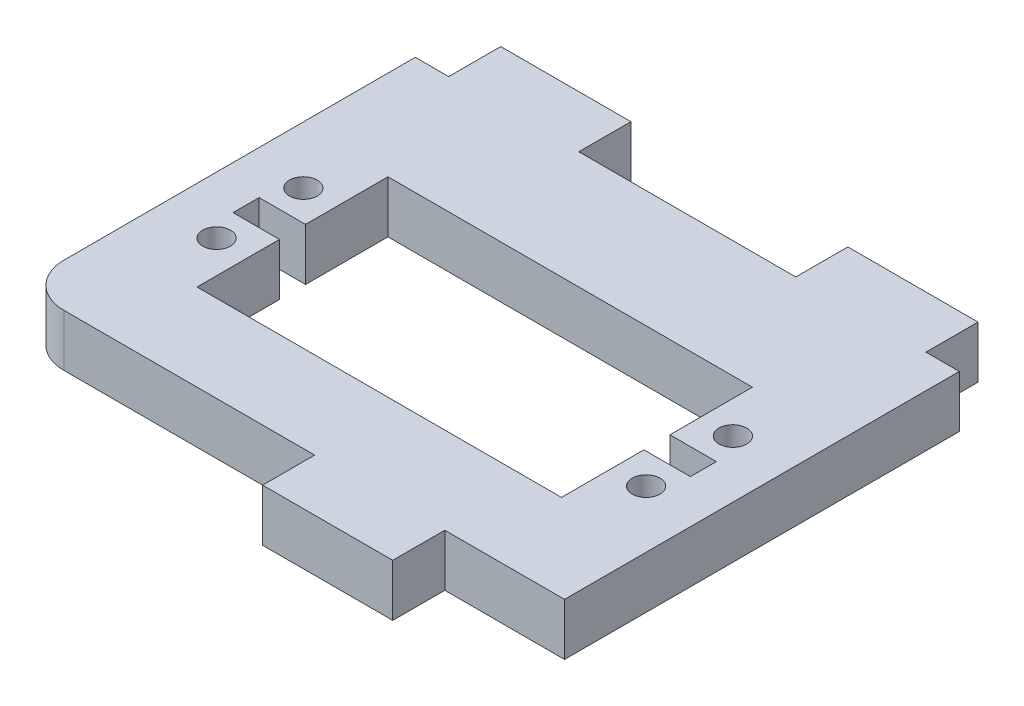
ISO-10303-21;
HEADER;
FILE_DESCRIPTION(('STEP AP214'),'2;1');
FILE_NAME('part.step','',(''),(''),'','','');
FILE_SCHEMA(('AUTOMOTIVE_DESIGN { 1 0 10303 214 1 1 1 1 }'));
ENDSEC;
DATA;
#1=APPLICATION_CONTEXT('core data for automotive mechanical design processes');
#2=APPLICATION_PROTOCOL_DEFINITION('international standard','automotive_design',2000,#1);
#3=PRODUCT_CONTEXT('',#1,'mechanical');
#4=PRODUCT('Part','Part','',(#3));
#5=PRODUCT_RELATED_PRODUCT_CATEGORY('part','',(#4));
#6=PRODUCT_DEFINITION_FORMATION('','',#4);
#7=PRODUCT_DEFINITION_CONTEXT('part definition',#1,'design');
#8=PRODUCT_DEFINITION('design','',#6,#7);
#9=PRODUCT_DEFINITION_SHAPE('','',#8);
#10=(LENGTH_UNIT() NAMED_UNIT(*) SI_UNIT(.MILLI.,.METRE.));
#11=(NAMED_UNIT(*) PLANE_ANGLE_UNIT() SI_UNIT($,.RADIAN.));
#12=(NAMED_UNIT(*) SI_UNIT($,.STERADIAN.) SOLID_ANGLE_UNIT());
#13=UNCERTAINTY_MEASURE_WITH_UNIT(LENGTH_MEASURE(1.E-05),#10,'distance_accuracy_value','');
#14=(GEOMETRIC_REPRESENTATION_CONTEXT(3) GLOBAL_UNCERTAINTY_ASSIGNED_CONTEXT((#13)) GLOBAL_UNIT_ASSIGNED_CONTEXT((#10,
#11,#12)) REPRESENTATION_CONTEXT('',''));
#15=CARTESIAN_POINT('',(0.,0.,0.));
#16=DIRECTION('',(0.,0.,1.));
#17=DIRECTION('',(1.,0.,0.));
#18=AXIS2_PLACEMENT_3D('',#15,#16,#17);
#19=CARTESIAN_POINT('',(2.55259,0.,27.));
#20=DIRECTION('',(-1.,0.,0.));
#21=DIRECTION('',(0.,0.,1.));
#22=AXIS2_PLACEMENT_3D('',#19,#20,#21);
#23=PLANE('',#22);
#24=DIRECTION('',(0.,0.,-1.));
#25=VECTOR('',#24,1.);
#26=CARTESIAN_POINT('',(2.55259,-6.,27.));
#27=LINE('',#26,#25);
#28=CARTESIAN_POINT('',(2.55259,-6.,27.));
#29=VERTEX_POINT('',#28);
#30=CARTESIAN_POINT('',(2.55258999999999,-6.,21.));
#31=VERTEX_POINT('',#30);
#32=EDGE_CURVE('E345',#29,#31,#27,.T.);
#33=ORIENTED_EDGE('',*,*,#32,.F.);
#34=DIRECTION('',(0.,-1.,0.));
#35=VECTOR('',#34,1.);
#36=CARTESIAN_POINT('',(2.55259,0.,27.));
#37=LINE('',#36,#35);
#38=CARTESIAN_POINT('',(2.55259,0.,27.));
#39=VERTEX_POINT('',#38);
#40=EDGE_CURVE('E11',#39,#29,#37,.T.);
#41=ORIENTED_EDGE('',*,*,#40,.F.);
#42=DIRECTION('',(0.,0.,-1.));
#43=VECTOR('',#42,1.);
#44=CARTESIAN_POINT('',(2.55259,0.,27.));
#45=LINE('',#44,#43);
#46=CARTESIAN_POINT('',(2.55258999999999,0.,21.));
#47=VERTEX_POINT('',#46);
#48=EDGE_CURVE('E348',#39,#47,#45,.T.);
#49=ORIENTED_EDGE('',*,*,#48,.T.);
#50=DIRECTION('',(0.,-1.,0.));
#51=VECTOR('',#50,1.);
#52=CARTESIAN_POINT('',(2.55258999999999,0.,21.));
#53=LINE('',#52,#51);
#54=EDGE_CURVE('E35',#47,#31,#53,.T.);
#55=ORIENTED_EDGE('',*,*,#54,.T.);
#56=EDGE_LOOP('',(#33,#41,#49,#55));
#57=FACE_BOUND('',#56,.T.);
#58=ADVANCED_FACE('F32',(#57),#23,.T.);
#59=CARTESIAN_POINT('',(17.55259,0.,27.));
#60=DIRECTION('',(0.,0.,1.));
#61=DIRECTION('',(1.,0.,0.));
#62=AXIS2_PLACEMENT_3D('',#59,#60,#61);
#63=PLANE('',#62);
#64=DIRECTION('',(-1.,0.,0.));
#65=VECTOR('',#64,1.);
#66=CARTESIAN_POINT('',(17.55259,-6.,27.));
#67=LINE('',#66,#65);
#68=CARTESIAN_POINT('',(17.55259,-6.,27.));
#69=VERTEX_POINT('',#68);
#70=EDGE_CURVE('E352',#69,#29,#67,.T.);
#71=ORIENTED_EDGE('',*,*,#70,.F.);
#72=DIRECTION('',(0.,-1.,0.));
#73=VECTOR('',#72,1.);
#74=CARTESIAN_POINT('',(17.55259,0.,27.));
#75=LINE('',#74,#73);
#76=CARTESIAN_POINT('',(17.55259,0.,27.));
#77=VERTEX_POINT('',#76);
#78=EDGE_CURVE('E40',#77,#69,#75,.T.);
#79=ORIENTED_EDGE('',*,*,#78,.F.);
#80=DIRECTION('',(-1.,0.,0.));
#81=VECTOR('',#80,1.);
#82=CARTESIAN_POINT('',(17.55259,0.,27.));
#83=LINE('',#82,#81);
#84=EDGE_CURVE('E397',#77,#39,#83,.T.);
#85=ORIENTED_EDGE('',*,*,#84,.T.);
#86=ORIENTED_EDGE('',*,*,#40,.T.);
#87=EDGE_LOOP('',(#71,#79,#85,#86));
#88=FACE_BOUND('',#87,.T.);
#89=ADVANCED_FACE('F489',(#88),#63,.T.);
#90=CARTESIAN_POINT('',(17.55259,0.,21.));
#91=DIRECTION('',(1.,0.,0.));
#92=DIRECTION('',(0.,0.,-1.));
#93=AXIS2_PLACEMENT_3D('',#90,#91,#92);
#94=PLANE('',#93);
#95=DIRECTION('',(0.,0.,1.));
#96=VECTOR('',#95,1.);
#97=CARTESIAN_POINT('',(17.55259,-6.,21.));
#98=LINE('',#97,#96);
#99=CARTESIAN_POINT('',(17.55259,-6.,21.));
#100=VERTEX_POINT('',#99);
#101=EDGE_CURVE('E444',#100,#69,#98,.T.);
#102=ORIENTED_EDGE('',*,*,#101,.F.);
#103=DIRECTION('',(0.,-1.,0.));
#104=VECTOR('',#103,1.);
#105=CARTESIAN_POINT('',(17.55259,0.,21.));
#106=LINE('',#105,#104);
#107=CARTESIAN_POINT('',(17.55259,0.,21.));
#108=VERTEX_POINT('',#107);
#109=EDGE_CURVE('E450',#108,#100,#106,.T.);
#110=ORIENTED_EDGE('',*,*,#109,.F.);
#111=DIRECTION('',(0.,0.,1.));
#112=VECTOR('',#111,1.);
#113=CARTESIAN_POINT('',(17.55259,0.,21.));
#114=LINE('',#113,#112);
#115=EDGE_CURVE('E394',#108,#77,#114,.T.);
#116=ORIENTED_EDGE('',*,*,#115,.T.);
#117=ORIENTED_EDGE('',*,*,#78,.T.);
#118=EDGE_LOOP('',(#102,#110,#116,#117));
#119=FACE_BOUND('',#118,.T.);
#120=ADVANCED_FACE('F545',(#119),#94,.T.);
#121=CARTESIAN_POINT('',(31.35,0.,21.));
#122=DIRECTION('',(0.,0.,1.));
#123=DIRECTION('',(1.,0.,0.));
#124=AXIS2_PLACEMENT_3D('',#121,#122,#123);
#125=PLANE('',#124);
#126=DIRECTION('',(-1.,0.,0.));
#127=VECTOR('',#126,1.);
#128=CARTESIAN_POINT('',(31.35,-6.,21.));
#129=LINE('',#128,#127);
#130=CARTESIAN_POINT('',(31.35,-6.,21.));
#131=VERTEX_POINT('',#130);
#132=EDGE_CURVE('E441',#131,#100,#129,.T.);
#133=ORIENTED_EDGE('',*,*,#132,.F.);
#134=DIRECTION('',(0.,-1.,0.));
#135=VECTOR('',#134,1.);
#136=CARTESIAN_POINT('',(31.35,0.,21.));
#137=LINE('',#136,#135);
#138=CARTESIAN_POINT('',(31.35,0.,21.));
#139=VERTEX_POINT('',#138);
#140=EDGE_CURVE('E452',#139,#131,#137,.T.);
#141=ORIENTED_EDGE('',*,*,#140,.F.);
#142=DIRECTION('',(-1.,0.,0.));
#143=VECTOR('',#142,1.);
#144=CARTESIAN_POINT('',(31.35,0.,21.));
#145=LINE('',#144,#143);
#146=EDGE_CURVE('E391',#139,#108,#145,.T.);
#147=ORIENTED_EDGE('',*,*,#146,.T.);
#148=ORIENTED_EDGE('',*,*,#109,.T.);
#149=EDGE_LOOP('',(#133,#141,#147,#148));
#150=FACE_BOUND('',#149,.T.);
#151=ADVANCED_FACE('F543',(#150),#125,.T.);
#152=CARTESIAN_POINT('',(31.35,0.,-24.5));
#153=DIRECTION('',(1.,0.,0.));
#154=DIRECTION('',(0.,0.,-1.));
#155=AXIS2_PLACEMENT_3D('',#152,#153,#154);
#156=PLANE('',#155);
#157=DIRECTION('',(0.,0.,1.));
#158=VECTOR('',#157,1.);
#159=CARTESIAN_POINT('',(31.35,-6.,-24.5));
#160=LINE('',#159,#158);
#161=CARTESIAN_POINT('',(31.35,-6.,-24.5));
#162=VERTEX_POINT('',#161);
#163=EDGE_CURVE('E438',#162,#131,#160,.T.);
#164=ORIENTED_EDGE('',*,*,#163,.F.);
#165=DIRECTION('',(0.,-1.,0.));
#166=VECTOR('',#165,1.);
#167=CARTESIAN_POINT('',(31.35,0.,-24.5));
#168=LINE('',#167,#166);
#169=CARTESIAN_POINT('',(31.35,0.,-24.5));
#170=VERTEX_POINT('',#169);
#171=EDGE_CURVE('E454',#170,#162,#168,.T.);
#172=ORIENTED_EDGE('',*,*,#171,.F.);
#173=DIRECTION('',(0.,0.,1.));
#174=VECTOR('',#173,1.);
#175=CARTESIAN_POINT('',(31.35,0.,-24.5));
#176=LINE('',#175,#174);
#177=EDGE_CURVE('E388',#170,#139,#176,.T.);
#178=ORIENTED_EDGE('',*,*,#177,.T.);
#179=ORIENTED_EDGE('',*,*,#140,.T.);
#180=EDGE_LOOP('',(#164,#172,#178,#179));
#181=FACE_BOUND('',#180,.T.);
#182=ADVANCED_FACE('F539',(#181),#156,.T.);
#183=CARTESIAN_POINT('',(27.5,0.,-24.5));
#184=DIRECTION('',(0.,0.,-1.));
#185=DIRECTION('',(-1.,0.,0.));
#186=AXIS2_PLACEMENT_3D('',#183,#184,#185);
#187=PLANE('',#186);
#188=DIRECTION('',(1.,0.,0.));
#189=VECTOR('',#188,1.);
#190=CARTESIAN_POINT('',(27.5,-6.,-24.5));
#191=LINE('',#190,#189);
#192=CARTESIAN_POINT('',(27.5,-6.,-24.5));
#193=VERTEX_POINT('',#192);
#194=EDGE_CURVE('E435',#193,#162,#191,.T.);
#195=ORIENTED_EDGE('',*,*,#194,.F.);
#196=DIRECTION('',(0.,-1.,0.));
#197=VECTOR('',#196,1.);
#198=CARTESIAN_POINT('',(27.5,0.,-24.5));
#199=LINE('',#198,#197);
#200=CARTESIAN_POINT('',(27.5,0.,-24.5));
#201=VERTEX_POINT('',#200);
#202=EDGE_CURVE('E456',#201,#193,#199,.T.);
#203=ORIENTED_EDGE('',*,*,#202,.F.);
#204=DIRECTION('',(1.,0.,0.));
#205=VECTOR('',#204,1.);
#206=CARTESIAN_POINT('',(27.5,0.,-24.5));
#207=LINE('',#206,#205);
#208=EDGE_CURVE('E385',#201,#170,#207,.T.);
#209=ORIENTED_EDGE('',*,*,#208,.T.);
#210=ORIENTED_EDGE('',*,*,#171,.T.);
#211=EDGE_LOOP('',(#195,#203,#209,#210));
#212=FACE_BOUND('',#211,.T.);
#213=ADVANCED_FACE('F535',(#212),#187,.T.);
#214=CARTESIAN_POINT('',(27.5,0.,-30.5));
#215=DIRECTION('',(1.,0.,0.));
#216=DIRECTION('',(0.,0.,-1.));
#217=AXIS2_PLACEMENT_3D('',#214,#215,#216);
#218=PLANE('',#217);
#219=DIRECTION('',(0.,0.,1.));
#220=VECTOR('',#219,1.);
#221=CARTESIAN_POINT('',(27.5,-6.,-30.5));
#222=LINE('',#221,#220);
#223=CARTESIAN_POINT('',(27.5,-6.,-30.5));
#224=VERTEX_POINT('',#223);
#225=EDGE_CURVE('E432',#224,#193,#222,.T.);
#226=ORIENTED_EDGE('',*,*,#225,.F.);
#227=DIRECTION('',(0.,-1.,0.));
#228=VECTOR('',#227,1.);
#229=CARTESIAN_POINT('',(27.5,0.,-30.5));
#230=LINE('',#229,#228);
#231=CARTESIAN_POINT('',(27.5,0.,-30.5));
#232=VERTEX_POINT('',#231);
#233=EDGE_CURVE('E458',#232,#224,#230,.T.);
#234=ORIENTED_EDGE('',*,*,#233,.F.);
#235=DIRECTION('',(0.,0.,1.));
#236=VECTOR('',#235,1.);
#237=CARTESIAN_POINT('',(27.5,0.,-30.5));
#238=LINE('',#237,#236);
#239=EDGE_CURVE('E382',#232,#201,#238,.T.);
#240=ORIENTED_EDGE('',*,*,#239,.T.);
#241=ORIENTED_EDGE('',*,*,#202,.T.);
#242=EDGE_LOOP('',(#226,#234,#240,#241));
#243=FACE_BOUND('',#242,.T.);
#244=ADVANCED_FACE('F531',(#243),#218,.T.);
#245=CARTESIAN_POINT('',(12.5,0.,-30.5));
#246=DIRECTION('',(0.,0.,-1.));
#247=DIRECTION('',(-1.,0.,0.));
#248=AXIS2_PLACEMENT_3D('',#245,#246,#247);
#249=PLANE('',#248);
#250=DIRECTION('',(1.,0.,0.));
#251=VECTOR('',#250,1.);
#252=CARTESIAN_POINT('',(12.5,-6.,-30.5));
#253=LINE('',#252,#251);
#254=CARTESIAN_POINT('',(12.5,-6.,-30.5));
#255=VERTEX_POINT('',#254);
#256=EDGE_CURVE('E429',#255,#224,#253,.T.);
#257=ORIENTED_EDGE('',*,*,#256,.F.);
#258=DIRECTION('',(0.,-1.,0.));
#259=VECTOR('',#258,1.);
#260=CARTESIAN_POINT('',(12.5,0.,-30.5));
#261=LINE('',#260,#259);
#262=CARTESIAN_POINT('',(12.5,0.,-30.5));
#263=VERTEX_POINT('',#262);
#264=EDGE_CURVE('E460',#263,#255,#261,.T.);
#265=ORIENTED_EDGE('',*,*,#264,.F.);
#266=DIRECTION('',(1.,0.,0.));
#267=VECTOR('',#266,1.);
#268=CARTESIAN_POINT('',(12.5,0.,-30.5));
#269=LINE('',#268,#267);
#270=EDGE_CURVE('E379',#263,#232,#269,.T.);
#271=ORIENTED_EDGE('',*,*,#270,.T.);
#272=ORIENTED_EDGE('',*,*,#233,.T.);
#273=EDGE_LOOP('',(#257,#265,#271,#272));
#274=FACE_BOUND('',#273,.T.);
#275=ADVANCED_FACE('F527',(#274),#249,.T.);
#276=CARTESIAN_POINT('',(12.5,0.,-24.5));
#277=DIRECTION('',(-1.,0.,0.));
#278=DIRECTION('',(0.,0.,1.));
#279=AXIS2_PLACEMENT_3D('',#276,#277,#278);
#280=PLANE('',#279);
#281=DIRECTION('',(0.,0.,-1.));
#282=VECTOR('',#281,1.);
#283=CARTESIAN_POINT('',(12.5,-6.,-24.5));
#284=LINE('',#283,#282);
#285=CARTESIAN_POINT('',(12.5,-6.,-24.5));
#286=VERTEX_POINT('',#285);
#287=EDGE_CURVE('E426',#286,#255,#284,.T.);
#288=ORIENTED_EDGE('',*,*,#287,.F.);
#289=DIRECTION('',(0.,-1.,0.));
#290=VECTOR('',#289,1.);
#291=CARTESIAN_POINT('',(12.5,0.,-24.5));
#292=LINE('',#291,#290);
#293=CARTESIAN_POINT('',(12.5,0.,-24.5));
#294=VERTEX_POINT('',#293);
#295=EDGE_CURVE('E462',#294,#286,#292,.T.);
#296=ORIENTED_EDGE('',*,*,#295,.F.);
#297=DIRECTION('',(0.,0.,-1.));
#298=VECTOR('',#297,1.);
#299=CARTESIAN_POINT('',(12.5,0.,-24.5));
#300=LINE('',#299,#298);
#301=EDGE_CURVE('E376',#294,#263,#300,.T.);
#302=ORIENTED_EDGE('',*,*,#301,.T.);
#303=ORIENTED_EDGE('',*,*,#264,.T.);
#304=EDGE_LOOP('',(#288,#296,#302,#303));
#305=FACE_BOUND('',#304,.T.);
#306=ADVANCED_FACE('F523',(#305),#280,.T.);
#307=CARTESIAN_POINT('',(-12.5,0.,-24.5));
#308=DIRECTION('',(0.,0.,-1.));
#309=DIRECTION('',(-1.,0.,0.));
#310=AXIS2_PLACEMENT_3D('',#307,#308,#309);
#311=PLANE('',#310);
#312=DIRECTION('',(1.,0.,0.));
#313=VECTOR('',#312,1.);
#314=CARTESIAN_POINT('',(-12.5,-6.,-24.5));
#315=LINE('',#314,#313);
#316=CARTESIAN_POINT('',(-12.5,-6.,-24.5));
#317=VERTEX_POINT('',#316);
#318=EDGE_CURVE('E423',#317,#286,#315,.T.);
#319=ORIENTED_EDGE('',*,*,#318,.F.);
#320=DIRECTION('',(0.,-1.,0.));
#321=VECTOR('',#320,1.);
#322=CARTESIAN_POINT('',(-12.5,0.,-24.5));
#323=LINE('',#322,#321);
#324=CARTESIAN_POINT('',(-12.5,0.,-24.5));
#325=VERTEX_POINT('',#324);
#326=EDGE_CURVE('E464',#325,#317,#323,.T.);
#327=ORIENTED_EDGE('',*,*,#326,.F.);
#328=DIRECTION('',(1.,0.,0.));
#329=VECTOR('',#328,1.);
#330=CARTESIAN_POINT('',(-12.5,0.,-24.5));
#331=LINE('',#330,#329);
#332=EDGE_CURVE('E373',#325,#294,#331,.T.);
#333=ORIENTED_EDGE('',*,*,#332,.T.);
#334=ORIENTED_EDGE('',*,*,#295,.T.);
#335=EDGE_LOOP('',(#319,#327,#333,#334));
#336=FACE_BOUND('',#335,.T.);
#337=ADVANCED_FACE('F519',(#336),#311,.T.);
#338=CARTESIAN_POINT('',(-12.5,0.,-30.5));
#339=DIRECTION('',(1.,0.,0.));
#340=DIRECTION('',(0.,0.,-1.));
#341=AXIS2_PLACEMENT_3D('',#338,#339,#340);
#342=PLANE('',#341);
#343=DIRECTION('',(0.,0.,1.));
#344=VECTOR('',#343,1.);
#345=CARTESIAN_POINT('',(-12.5,-6.,-30.5));
#346=LINE('',#345,#344);
#347=CARTESIAN_POINT('',(-12.5,-6.,-30.5));
#348=VERTEX_POINT('',#347);
#349=EDGE_CURVE('E420',#348,#317,#346,.T.);
#350=ORIENTED_EDGE('',*,*,#349,.F.);
#351=DIRECTION('',(0.,-1.,0.));
#352=VECTOR('',#351,1.);
#353=CARTESIAN_POINT('',(-12.5,0.,-30.5));
#354=LINE('',#353,#352);
#355=CARTESIAN_POINT('',(-12.5,0.,-30.5));
#356=VERTEX_POINT('',#355);
#357=EDGE_CURVE('E466',#356,#348,#354,.T.);
#358=ORIENTED_EDGE('',*,*,#357,.F.);
#359=DIRECTION('',(0.,0.,1.));
#360=VECTOR('',#359,1.);
#361=CARTESIAN_POINT('',(-12.5,0.,-30.5));
#362=LINE('',#361,#360);
#363=EDGE_CURVE('E370',#356,#325,#362,.T.);
#364=ORIENTED_EDGE('',*,*,#363,.T.);
#365=ORIENTED_EDGE('',*,*,#326,.T.);
#366=EDGE_LOOP('',(#350,#358,#364,#365));
#367=FACE_BOUND('',#366,.T.);
#368=ADVANCED_FACE('F515',(#367),#342,.T.);
#369=CARTESIAN_POINT('',(-27.5,0.,-30.5));
#370=DIRECTION('',(0.,0.,-1.));
#371=DIRECTION('',(-1.,0.,0.));
#372=AXIS2_PLACEMENT_3D('',#369,#370,#371);
#373=PLANE('',#372);
#374=DIRECTION('',(1.,0.,0.));
#375=VECTOR('',#374,1.);
#376=CARTESIAN_POINT('',(-27.5,-6.,-30.5));
#377=LINE('',#376,#375);
#378=CARTESIAN_POINT('',(-27.5,-6.,-30.5));
#379=VERTEX_POINT('',#378);
#380=EDGE_CURVE('E417',#379,#348,#377,.T.);
#381=ORIENTED_EDGE('',*,*,#380,.F.);
#382=DIRECTION('',(0.,-1.,0.));
#383=VECTOR('',#382,1.);
#384=CARTESIAN_POINT('',(-27.5,0.,-30.5));
#385=LINE('',#384,#383);
#386=CARTESIAN_POINT('',(-27.5,0.,-30.5));
#387=VERTEX_POINT('',#386);
#388=EDGE_CURVE('E468',#387,#379,#385,.T.);
#389=ORIENTED_EDGE('',*,*,#388,.F.);
#390=DIRECTION('',(1.,0.,0.));
#391=VECTOR('',#390,1.);
#392=CARTESIAN_POINT('',(-27.5,0.,-30.5));
#393=LINE('',#392,#391);
#394=EDGE_CURVE('E367',#387,#356,#393,.T.);
#395=ORIENTED_EDGE('',*,*,#394,.T.);
#396=ORIENTED_EDGE('',*,*,#357,.T.);
#397=EDGE_LOOP('',(#381,#389,#395,#396));
#398=FACE_BOUND('',#397,.T.);
#399=ADVANCED_FACE('F511',(#398),#373,.T.);
#400=CARTESIAN_POINT('',(-27.5,0.,-24.5));
#401=DIRECTION('',(-1.,0.,0.));
#402=DIRECTION('',(0.,0.,1.));
#403=AXIS2_PLACEMENT_3D('',#400,#401,#402);
#404=PLANE('',#403);
#405=DIRECTION('',(0.,0.,-1.));
#406=VECTOR('',#405,1.);
#407=CARTESIAN_POINT('',(-27.5,-6.,-24.5));
#408=LINE('',#407,#406);
#409=CARTESIAN_POINT('',(-27.5,-6.,-24.5));
#410=VERTEX_POINT('',#409);
#411=EDGE_CURVE('E414',#410,#379,#408,.T.);
#412=ORIENTED_EDGE('',*,*,#411,.F.);
#413=DIRECTION('',(0.,-1.,0.));
#414=VECTOR('',#413,1.);
#415=CARTESIAN_POINT('',(-27.5,0.,-24.5));
#416=LINE('',#415,#414);
#417=CARTESIAN_POINT('',(-27.5,0.,-24.5));
#418=VERTEX_POINT('',#417);
#419=EDGE_CURVE('E470',#418,#410,#416,.T.);
#420=ORIENTED_EDGE('',*,*,#419,.F.);
#421=DIRECTION('',(0.,0.,-1.));
#422=VECTOR('',#421,1.);
#423=CARTESIAN_POINT('',(-27.5,0.,-24.5));
#424=LINE('',#423,#422);
#425=EDGE_CURVE('E364',#418,#387,#424,.T.);
#426=ORIENTED_EDGE('',*,*,#425,.T.);
#427=ORIENTED_EDGE('',*,*,#388,.T.);
#428=EDGE_LOOP('',(#412,#420,#426,#427));
#429=FACE_BOUND('',#428,.T.);
#430=ADVANCED_FACE('F507',(#429),#404,.T.);
#431=CARTESIAN_POINT('',(-31.35,0.,-24.5));
#432=DIRECTION('',(0.,0.,-1.));
#433=DIRECTION('',(-1.,0.,0.));
#434=AXIS2_PLACEMENT_3D('',#431,#432,#433);
#435=PLANE('',#434);
#436=DIRECTION('',(1.,0.,0.));
#437=VECTOR('',#436,1.);
#438=CARTESIAN_POINT('',(-31.35,-6.,-24.5));
#439=LINE('',#438,#437);
#440=CARTESIAN_POINT('',(-31.35,-6.,-24.5));
#441=VERTEX_POINT('',#440);
#442=EDGE_CURVE('E411',#441,#410,#439,.T.);
#443=ORIENTED_EDGE('',*,*,#442,.F.);
#444=DIRECTION('',(0.,-1.,0.));
#445=VECTOR('',#444,1.);
#446=CARTESIAN_POINT('',(-31.35,0.,-24.5));
#447=LINE('',#446,#445);
#448=CARTESIAN_POINT('',(-31.35,0.,-24.5));
#449=VERTEX_POINT('',#448);
#450=EDGE_CURVE('E472',#449,#441,#447,.T.);
#451=ORIENTED_EDGE('',*,*,#450,.F.);
#452=DIRECTION('',(1.,0.,0.));
#453=VECTOR('',#452,1.);
#454=CARTESIAN_POINT('',(-31.35,0.,-24.5));
#455=LINE('',#454,#453);
#456=EDGE_CURVE('E361',#449,#418,#455,.T.);
#457=ORIENTED_EDGE('',*,*,#456,.T.);
#458=ORIENTED_EDGE('',*,*,#419,.T.);
#459=EDGE_LOOP('',(#443,#451,#457,#458));
#460=FACE_BOUND('',#459,.T.);
#461=ADVANCED_FACE('F503',(#460),#435,.T.);
#462=CARTESIAN_POINT('',(-31.35,0.,16.));
#463=DIRECTION('',(-1.,0.,0.));
#464=DIRECTION('',(0.,0.,1.));
#465=AXIS2_PLACEMENT_3D('',#462,#463,#464);
#466=PLANE('',#465);
#467=DIRECTION('',(0.,0.,-1.));
#468=VECTOR('',#467,1.);
#469=CARTESIAN_POINT('',(-31.35,-6.,16.));
#470=LINE('',#469,#468);
#471=CARTESIAN_POINT('',(-31.35,-6.,16.));
#472=VERTEX_POINT('',#471);
#473=EDGE_CURVE('E408',#472,#441,#470,.T.);
#474=ORIENTED_EDGE('',*,*,#473,.F.);
#475=DIRECTION('',(0.,-1.,0.));
#476=VECTOR('',#475,1.);
#477=CARTESIAN_POINT('',(-31.35,0.,16.));
#478=LINE('',#477,#476);
#479=CARTESIAN_POINT('',(-31.35,0.,16.));
#480=VERTEX_POINT('',#479);
#481=EDGE_CURVE('E474',#480,#472,#478,.T.);
#482=ORIENTED_EDGE('',*,*,#481,.F.);
#483=DIRECTION('',(0.,0.,-1.));
#484=VECTOR('',#483,1.);
#485=CARTESIAN_POINT('',(-31.35,0.,16.));
#486=LINE('',#485,#484);
#487=EDGE_CURVE('E358',#480,#449,#486,.T.);
#488=ORIENTED_EDGE('',*,*,#487,.T.);
#489=ORIENTED_EDGE('',*,*,#450,.T.);
#490=EDGE_LOOP('',(#474,#482,#488,#489));
#491=FACE_BOUND('',#490,.T.);
#492=ADVANCED_FACE('F501',(#491),#466,.T.);
#493=CARTESIAN_POINT('',(-26.35,0.,16.));
#494=DIRECTION('',(0.,-1.,0.));
#495=DIRECTION('',(0.,0.,-1.));
#496=AXIS2_PLACEMENT_3D('',#493,#494,#495);
#497=CYLINDRICAL_SURFACE('',#496,5.);
#498=CARTESIAN_POINT('',(-26.35,-6.,16.));
#499=DIRECTION('',(0.,-1.,0.));
#500=DIRECTION('',(0.,0.,-1.));
#501=AXIS2_PLACEMENT_3D('',#498,#499,#500);
#502=CIRCLE('',#501,5.);
#503=CARTESIAN_POINT('',(-26.35,-6.,21.));
#504=VERTEX_POINT('',#503);
#505=EDGE_CURVE('E405',#504,#472,#502,.T.);
#506=ORIENTED_EDGE('',*,*,#505,.F.);
#507=DIRECTION('',(0.,-1.,0.));
#508=VECTOR('',#507,1.);
#509=CARTESIAN_POINT('',(-26.35,0.,21.));
#510=LINE('',#509,#508);
#511=CARTESIAN_POINT('',(-26.35,0.,21.));
#512=VERTEX_POINT('',#511);
#513=EDGE_CURVE('E475',#512,#504,#510,.T.);
#514=ORIENTED_EDGE('',*,*,#513,.F.);
#515=CARTESIAN_POINT('',(-26.35,0.,16.));
#516=DIRECTION('',(0.,-1.,0.));
#517=DIRECTION('',(0.,0.,-1.));
#518=AXIS2_PLACEMENT_3D('',#515,#516,#517);
#519=CIRCLE('',#518,5.);
#520=EDGE_CURVE('E355',#512,#480,#519,.T.);
#521=ORIENTED_EDGE('',*,*,#520,.T.);
#522=ORIENTED_EDGE('',*,*,#481,.T.);
#523=EDGE_LOOP('',(#506,#514,#521,#522));
#524=FACE_BOUND('',#523,.T.);
#525=ADVANCED_FACE('F497',(#524),#497,.T.);
#526=CARTESIAN_POINT('',(2.55258999999999,0.,21.));
#527=DIRECTION('',(0.,0.,1.));
#528=DIRECTION('',(1.,0.,0.));
#529=AXIS2_PLACEMENT_3D('',#526,#527,#528);
#530=PLANE('',#529);
#531=DIRECTION('',(-1.,0.,0.));
#532=VECTOR('',#531,1.);
#533=CARTESIAN_POINT('',(2.55258999999999,-6.,21.));
#534=LINE('',#533,#532);
#535=EDGE_CURVE('E402',#31,#504,#534,.T.);
#536=ORIENTED_EDGE('',*,*,#535,.F.);
#537=ORIENTED_EDGE('',*,*,#54,.F.);
#538=DIRECTION('',(-1.,0.,0.));
#539=VECTOR('',#538,1.);
#540=CARTESIAN_POINT('',(2.55258999999999,0.,21.));
#541=LINE('',#540,#539);
#542=EDGE_CURVE('E351',#47,#512,#541,.T.);
#543=ORIENTED_EDGE('',*,*,#542,.T.);
#544=ORIENTED_EDGE('',*,*,#513,.T.);
#545=EDGE_LOOP('',(#536,#537,#543,#544));
#546=FACE_BOUND('',#545,.T.);
#547=ADVANCED_FACE('F483',(#546),#530,.T.);
#548=CARTESIAN_POINT('',(-26.35,0.,16.));
#549=DIRECTION('',(0.,-1.,0.));
#550=DIRECTION('',(0.,0.,-1.));
#551=AXIS2_PLACEMENT_3D('',#548,#549,#550);
#552=PLANE('',#551);
#553=DIRECTION('',(-1.,0.,0.));
#554=VECTOR('',#553,1.);
#555=CARTESIAN_POINT('',(-26.35,0.,1.5));
#556=LINE('',#555,#554);
#557=CARTESIAN_POINT('',(-21.,0.,1.5));
#558=VERTEX_POINT('',#557);
#559=CARTESIAN_POINT('',(-26.35,0.,1.5));
#560=VERTEX_POINT('',#559);
#561=EDGE_CURVE('E231',#558,#560,#556,.T.);
#562=ORIENTED_EDGE('',*,*,#561,.T.);
#563=DIRECTION('',(0.,0.,-1.));
#564=VECTOR('',#563,1.);
#565=CARTESIAN_POINT('',(-26.35,0.,-1.5));
#566=LINE('',#565,#564);
#567=CARTESIAN_POINT('',(-26.35,0.,-1.5));
#568=VERTEX_POINT('',#567);
#569=EDGE_CURVE('E225',#560,#568,#566,.T.);
#570=ORIENTED_EDGE('',*,*,#569,.T.);
#571=DIRECTION('',(1.,0.,0.));
#572=VECTOR('',#571,1.);
#573=CARTESIAN_POINT('',(-21.,0.,-1.5));
#574=LINE('',#573,#572);
#575=CARTESIAN_POINT('',(-21.,0.,-1.5));
#576=VERTEX_POINT('',#575);
#577=EDGE_CURVE('E234',#568,#576,#574,.T.);
#578=ORIENTED_EDGE('',*,*,#577,.T.);
#579=DIRECTION('',(0.,0.,-1.));
#580=VECTOR('',#579,1.);
#581=CARTESIAN_POINT('',(-21.,0.,-11.));
#582=LINE('',#581,#580);
#583=CARTESIAN_POINT('',(-21.,0.,-11.));
#584=VERTEX_POINT('',#583);
#585=EDGE_CURVE('E48',#576,#584,#582,.T.);
#586=ORIENTED_EDGE('',*,*,#585,.T.);
#587=DIRECTION('',(1.,0.,0.));
#588=VECTOR('',#587,1.);
#589=CARTESIAN_POINT('',(21.,0.,-11.));
#590=LINE('',#589,#588);
#591=CARTESIAN_POINT('',(21.,0.,-11.));
#592=VERTEX_POINT('',#591);
#593=EDGE_CURVE('E249',#584,#592,#590,.T.);
#594=ORIENTED_EDGE('',*,*,#593,.T.);
#595=DIRECTION('',(0.,0.,1.));
#596=VECTOR('',#595,1.);
#597=CARTESIAN_POINT('',(21.,0.,-1.49999999999999));
#598=LINE('',#597,#596);
#599=CARTESIAN_POINT('',(21.,0.,-1.49999999999999));
#600=VERTEX_POINT('',#599);
#601=EDGE_CURVE('E252',#592,#600,#598,.T.);
#602=ORIENTED_EDGE('',*,*,#601,.T.);
#603=DIRECTION('',(1.,0.,0.));
#604=VECTOR('',#603,1.);
#605=CARTESIAN_POINT('',(26.35,0.,-1.49999999999999));
#606=LINE('',#605,#604);
#607=CARTESIAN_POINT('',(26.35,0.,-1.49999999999999));
#608=VERTEX_POINT('',#607);
#609=EDGE_CURVE('E255',#600,#608,#606,.T.);
#610=ORIENTED_EDGE('',*,*,#609,.T.);
#611=DIRECTION('',(0.,0.,1.));
#612=VECTOR('',#611,1.);
#613=CARTESIAN_POINT('',(26.35,0.,1.49999999999999));
#614=LINE('',#613,#612);
#615=CARTESIAN_POINT('',(26.35,0.,1.49999999999999));
#616=VERTEX_POINT('',#615);
#617=EDGE_CURVE('E258',#608,#616,#614,.T.);
#618=ORIENTED_EDGE('',*,*,#617,.T.);
#619=DIRECTION('',(-1.,0.,0.));
#620=VECTOR('',#619,1.);
#621=CARTESIAN_POINT('',(21.,0.,1.49999999999999));
#622=LINE('',#621,#620);
#623=CARTESIAN_POINT('',(21.,0.,1.49999999999999));
#624=VERTEX_POINT('',#623);
#625=EDGE_CURVE('E261',#616,#624,#622,.T.);
#626=ORIENTED_EDGE('',*,*,#625,.T.);
#627=DIRECTION('',(0.,0.,1.));
#628=VECTOR('',#627,1.);
#629=CARTESIAN_POINT('',(21.,0.,11.));
#630=LINE('',#629,#628);
#631=CARTESIAN_POINT('',(21.,0.,11.));
#632=VERTEX_POINT('',#631);
#633=EDGE_CURVE('E264',#624,#632,#630,.T.);
#634=ORIENTED_EDGE('',*,*,#633,.T.);
#635=DIRECTION('',(-1.,0.,0.));
#636=VECTOR('',#635,1.);
#637=CARTESIAN_POINT('',(-21.,0.,11.));
#638=LINE('',#637,#636);
#639=CARTESIAN_POINT('',(-21.,0.,11.));
#640=VERTEX_POINT('',#639);
#641=EDGE_CURVE('E267',#632,#640,#638,.T.);
#642=ORIENTED_EDGE('',*,*,#641,.T.);
#643=DIRECTION('',(0.,0.,-1.));
#644=VECTOR('',#643,1.);
#645=CARTESIAN_POINT('',(-21.,0.,1.5));
#646=LINE('',#645,#644);
#647=EDGE_CURVE('E270',#640,#558,#646,.T.);
#648=ORIENTED_EDGE('',*,*,#647,.T.);
#649=EDGE_LOOP('',(#562,#570,#578,#586,#594,#602,#610,#618,#626,#634,#642,#648));
#650=FACE_BOUND('',#649,.T.);
#651=CARTESIAN_POINT('',(-24.75,0.,-5.));
#652=DIRECTION('',(0.,-1.,0.));
#653=DIRECTION('',(0.,0.,1.));
#654=AXIS2_PLACEMENT_3D('',#651,#652,#653);
#655=CIRCLE('',#654,1.60000000000001);
#656=CARTESIAN_POINT('',(-24.75,0.,-3.39999999999999));
#657=VERTEX_POINT('',#656);
#658=EDGE_CURVE('E324',#657,#657,#655,.T.);
#659=ORIENTED_EDGE('',*,*,#658,.T.);
#660=EDGE_LOOP('',(#659));
#661=FACE_BOUND('',#660,.T.);
#662=CARTESIAN_POINT('',(-24.75,0.,5.));
#663=DIRECTION('',(0.,-1.,0.));
#664=DIRECTION('',(0.,0.,1.));
#665=AXIS2_PLACEMENT_3D('',#662,#663,#664);
#666=CIRCLE('',#665,1.60000000000001);
#667=CARTESIAN_POINT('',(-24.75,0.,6.6));
#668=VERTEX_POINT('',#667);
#669=EDGE_CURVE('E330',#668,#668,#666,.T.);
#670=ORIENTED_EDGE('',*,*,#669,.T.);
#671=EDGE_LOOP('',(#670));
#672=FACE_BOUND('',#671,.T.);
#673=CARTESIAN_POINT('',(24.75,0.,-5.));
#674=DIRECTION('',(0.,-1.,0.));
#675=DIRECTION('',(0.,0.,1.));
#676=AXIS2_PLACEMENT_3D('',#673,#674,#675);
#677=CIRCLE('',#676,1.60000000000001);
#678=CARTESIAN_POINT('',(24.75,0.,-3.39999999999999));
#679=VERTEX_POINT('',#678);
#680=EDGE_CURVE('E336',#679,#679,#677,.T.);
#681=ORIENTED_EDGE('',*,*,#680,.T.);
#682=EDGE_LOOP('',(#681));
#683=FACE_BOUND('',#682,.T.);
#684=CARTESIAN_POINT('',(24.75,0.,5.));
#685=DIRECTION('',(0.,-1.,0.));
#686=DIRECTION('',(0.,0.,1.));
#687=AXIS2_PLACEMENT_3D('',#684,#685,#686);
#688=CIRCLE('',#687,1.60000000000001);
#689=CARTESIAN_POINT('',(24.75,0.,6.6));
#690=VERTEX_POINT('',#689);
#691=EDGE_CURVE('E342',#690,#690,#688,.T.);
#692=ORIENTED_EDGE('',*,*,#691,.T.);
#693=EDGE_LOOP('',(#692));
#694=FACE_BOUND('',#693,.T.);
#695=ORIENTED_EDGE('',*,*,#48,.F.);
#696=ORIENTED_EDGE('',*,*,#84,.F.);
#697=ORIENTED_EDGE('',*,*,#115,.F.);
#698=ORIENTED_EDGE('',*,*,#146,.F.);
#699=ORIENTED_EDGE('',*,*,#177,.F.);
#700=ORIENTED_EDGE('',*,*,#208,.F.);
#701=ORIENTED_EDGE('',*,*,#239,.F.);
#702=ORIENTED_EDGE('',*,*,#270,.F.);
#703=ORIENTED_EDGE('',*,*,#301,.F.);
#704=ORIENTED_EDGE('',*,*,#332,.F.);
#705=ORIENTED_EDGE('',*,*,#363,.F.);
#706=ORIENTED_EDGE('',*,*,#394,.F.);
#707=ORIENTED_EDGE('',*,*,#425,.F.);
#708=ORIENTED_EDGE('',*,*,#456,.F.);
#709=ORIENTED_EDGE('',*,*,#487,.F.);
#710=ORIENTED_EDGE('',*,*,#520,.F.);
#711=ORIENTED_EDGE('',*,*,#542,.F.);
#712=EDGE_LOOP('',(#695,#696,#697,#698,#699,#700,#701,#702,#703,#704,#705,#706,#707,#708,#709,
#710,#711));
#713=FACE_BOUND('',#712,.T.);
#714=ADVANCED_FACE('F238',(#650,#661,#672,#683,#694,#713),#552,.F.);
#715=CARTESIAN_POINT('',(-26.35,-6.,16.));
#716=DIRECTION('',(0.,-1.,0.));
#717=DIRECTION('',(0.,0.,-1.));
#718=AXIS2_PLACEMENT_3D('',#715,#716,#717);
#719=PLANE('',#718);
#720=DIRECTION('',(0.,0.,-1.));
#721=VECTOR('',#720,1.);
#722=CARTESIAN_POINT('',(-26.35,-6.,-1.5));
#723=LINE('',#722,#721);
#724=CARTESIAN_POINT('',(-26.35,-6.,1.5));
#725=VERTEX_POINT('',#724);
#726=CARTESIAN_POINT('',(-26.35,-6.,-1.5));
#727=VERTEX_POINT('',#726);
#728=EDGE_CURVE('E56',#725,#727,#723,.T.);
#729=ORIENTED_EDGE('',*,*,#728,.F.);
#730=DIRECTION('',(-1.,0.,0.));
#731=VECTOR('',#730,1.);
#732=CARTESIAN_POINT('',(-26.35,-6.,1.5));
#733=LINE('',#732,#731);
#734=CARTESIAN_POINT('',(-21.,-6.,1.5));
#735=VERTEX_POINT('',#734);
#736=EDGE_CURVE('E242',#735,#725,#733,.T.);
#737=ORIENTED_EDGE('',*,*,#736,.F.);
#738=DIRECTION('',(0.,0.,-1.));
#739=VECTOR('',#738,1.);
#740=CARTESIAN_POINT('',(-21.,-6.,1.5));
#741=LINE('',#740,#739);
#742=CARTESIAN_POINT('',(-21.,-6.,11.));
#743=VERTEX_POINT('',#742);
#744=EDGE_CURVE('E245',#743,#735,#741,.T.);
#745=ORIENTED_EDGE('',*,*,#744,.F.);
#746=DIRECTION('',(-1.,0.,0.));
#747=VECTOR('',#746,1.);
#748=CARTESIAN_POINT('',(-21.,-6.,11.));
#749=LINE('',#748,#747);
#750=CARTESIAN_POINT('',(21.,-6.,11.));
#751=VERTEX_POINT('',#750);
#752=EDGE_CURVE('E297',#751,#743,#749,.T.);
#753=ORIENTED_EDGE('',*,*,#752,.F.);
#754=DIRECTION('',(0.,0.,1.));
#755=VECTOR('',#754,1.);
#756=CARTESIAN_POINT('',(21.,-6.,11.));
#757=LINE('',#756,#755);
#758=CARTESIAN_POINT('',(21.,-6.,1.49999999999999));
#759=VERTEX_POINT('',#758);
#760=EDGE_CURVE('E294',#759,#751,#757,.T.);
#761=ORIENTED_EDGE('',*,*,#760,.F.);
#762=DIRECTION('',(-1.,0.,0.));
#763=VECTOR('',#762,1.);
#764=CARTESIAN_POINT('',(21.,-6.,1.49999999999999));
#765=LINE('',#764,#763);
#766=CARTESIAN_POINT('',(26.35,-6.,1.49999999999999));
#767=VERTEX_POINT('',#766);
#768=EDGE_CURVE('E291',#767,#759,#765,.T.);
#769=ORIENTED_EDGE('',*,*,#768,.F.);
#770=DIRECTION('',(0.,0.,1.));
#771=VECTOR('',#770,1.);
#772=CARTESIAN_POINT('',(26.35,-6.,1.49999999999999));
#773=LINE('',#772,#771);
#774=CARTESIAN_POINT('',(26.35,-6.,-1.49999999999999));
#775=VERTEX_POINT('',#774);
#776=EDGE_CURVE('E288',#775,#767,#773,.T.);
#777=ORIENTED_EDGE('',*,*,#776,.F.);
#778=DIRECTION('',(1.,0.,0.));
#779=VECTOR('',#778,1.);
#780=CARTESIAN_POINT('',(26.35,-6.,-1.49999999999999));
#781=LINE('',#780,#779);
#782=CARTESIAN_POINT('',(21.,-6.,-1.49999999999999));
#783=VERTEX_POINT('',#782);
#784=EDGE_CURVE('E285',#783,#775,#781,.T.);
#785=ORIENTED_EDGE('',*,*,#784,.F.);
#786=DIRECTION('',(0.,0.,1.));
#787=VECTOR('',#786,1.);
#788=CARTESIAN_POINT('',(21.,-6.,-1.49999999999999));
#789=LINE('',#788,#787);
#790=CARTESIAN_POINT('',(21.,-6.,-11.));
#791=VERTEX_POINT('',#790);
#792=EDGE_CURVE('E282',#791,#783,#789,.T.);
#793=ORIENTED_EDGE('',*,*,#792,.F.);
#794=DIRECTION('',(1.,0.,0.));
#795=VECTOR('',#794,1.);
#796=CARTESIAN_POINT('',(21.,-6.,-11.));
#797=LINE('',#796,#795);
#798=CARTESIAN_POINT('',(-21.,-6.,-11.));
#799=VERTEX_POINT('',#798);
#800=EDGE_CURVE('E279',#799,#791,#797,.T.);
#801=ORIENTED_EDGE('',*,*,#800,.F.);
#802=DIRECTION('',(0.,0.,-1.));
#803=VECTOR('',#802,1.);
#804=CARTESIAN_POINT('',(-21.,-6.,-11.));
#805=LINE('',#804,#803);
#806=CARTESIAN_POINT('',(-21.,-6.,-1.5));
#807=VERTEX_POINT('',#806);
#808=EDGE_CURVE('E276',#807,#799,#805,.T.);
#809=ORIENTED_EDGE('',*,*,#808,.F.);
#810=DIRECTION('',(1.,0.,0.));
#811=VECTOR('',#810,1.);
#812=CARTESIAN_POINT('',(-21.,-6.,-1.5));
#813=LINE('',#812,#811);
#814=EDGE_CURVE('E274',#727,#807,#813,.T.);
#815=ORIENTED_EDGE('',*,*,#814,.F.);
#816=EDGE_LOOP('',(#729,#737,#745,#753,#761,#769,#777,#785,#793,#801,#809,#815));
#817=FACE_BOUND('',#816,.T.);
#818=CARTESIAN_POINT('',(-24.75,-6.,-5.));
#819=DIRECTION('',(0.,-1.,0.));
#820=DIRECTION('',(0.,0.,1.));
#821=AXIS2_PLACEMENT_3D('',#818,#819,#820);
#822=CIRCLE('',#821,1.60000000000001);
#823=CARTESIAN_POINT('',(-24.75,-6.,-3.39999999999999));
#824=VERTEX_POINT('',#823);
#825=EDGE_CURVE('E304',#824,#824,#822,.T.);
#826=ORIENTED_EDGE('',*,*,#825,.F.);
#827=EDGE_LOOP('',(#826));
#828=FACE_BOUND('',#827,.T.);
#829=CARTESIAN_POINT('',(-24.75,-6.,5.));
#830=DIRECTION('',(0.,-1.,0.));
#831=DIRECTION('',(0.,0.,1.));
#832=AXIS2_PLACEMENT_3D('',#829,#830,#831);
#833=CIRCLE('',#832,1.60000000000001);
#834=CARTESIAN_POINT('',(-24.75,-6.,6.6));
#835=VERTEX_POINT('',#834);
#836=EDGE_CURVE('E327',#835,#835,#833,.T.);
#837=ORIENTED_EDGE('',*,*,#836,.F.);
#838=EDGE_LOOP('',(#837));
#839=FACE_BOUND('',#838,.T.);
#840=CARTESIAN_POINT('',(24.75,-6.,-5.));
#841=DIRECTION('',(0.,-1.,0.));
#842=DIRECTION('',(0.,0.,1.));
#843=AXIS2_PLACEMENT_3D('',#840,#841,#842);
#844=CIRCLE('',#843,1.60000000000001);
#845=CARTESIAN_POINT('',(24.75,-6.,-3.39999999999999));
#846=VERTEX_POINT('',#845);
#847=EDGE_CURVE('E333',#846,#846,#844,.T.);
#848=ORIENTED_EDGE('',*,*,#847,.F.);
#849=EDGE_LOOP('',(#848));
#850=FACE_BOUND('',#849,.T.);
#851=CARTESIAN_POINT('',(24.75,-6.,5.));
#852=DIRECTION('',(0.,-1.,0.));
#853=DIRECTION('',(0.,0.,1.));
#854=AXIS2_PLACEMENT_3D('',#851,#852,#853);
#855=CIRCLE('',#854,1.60000000000001);
#856=CARTESIAN_POINT('',(24.75,-6.,6.6));
#857=VERTEX_POINT('',#856);
#858=EDGE_CURVE('E339',#857,#857,#855,.T.);
#859=ORIENTED_EDGE('',*,*,#858,.F.);
#860=EDGE_LOOP('',(#859));
#861=FACE_BOUND('',#860,.T.);
#862=ORIENTED_EDGE('',*,*,#32,.T.);
#863=ORIENTED_EDGE('',*,*,#535,.T.);
#864=ORIENTED_EDGE('',*,*,#505,.T.);
#865=ORIENTED_EDGE('',*,*,#473,.T.);
#866=ORIENTED_EDGE('',*,*,#442,.T.);
#867=ORIENTED_EDGE('',*,*,#411,.T.);
#868=ORIENTED_EDGE('',*,*,#380,.T.);
#869=ORIENTED_EDGE('',*,*,#349,.T.);
#870=ORIENTED_EDGE('',*,*,#318,.T.);
#871=ORIENTED_EDGE('',*,*,#287,.T.);
#872=ORIENTED_EDGE('',*,*,#256,.T.);
#873=ORIENTED_EDGE('',*,*,#225,.T.);
#874=ORIENTED_EDGE('',*,*,#194,.T.);
#875=ORIENTED_EDGE('',*,*,#163,.T.);
#876=ORIENTED_EDGE('',*,*,#132,.T.);
#877=ORIENTED_EDGE('',*,*,#101,.T.);
#878=ORIENTED_EDGE('',*,*,#70,.T.);
#879=EDGE_LOOP('',(#862,#863,#864,#865,#866,#867,#868,#869,#870,#871,#872,#873,#874,#875,#876,
#877,#878));
#880=FACE_BOUND('',#879,.T.);
#881=ADVANCED_FACE('F485',(#817,#828,#839,#850,#861,#880),#719,.T.);
#882=CARTESIAN_POINT('',(24.75,0.,5.));
#883=DIRECTION('',(0.,-1.,0.));
#884=DIRECTION('',(0.,0.,-1.));
#885=AXIS2_PLACEMENT_3D('',#882,#883,#884);
#886=CYLINDRICAL_SURFACE('',#885,1.60000000000001);
#887=ORIENTED_EDGE('',*,*,#691,.F.);
#888=EDGE_LOOP('',(#887));
#889=FACE_BOUND('',#888,.T.);
#890=ORIENTED_EDGE('',*,*,#858,.T.);
#891=EDGE_LOOP('',(#890));
#892=FACE_BOUND('',#891,.T.);
#893=ADVANCED_FACE('F691',(#889,#892),#886,.F.);
#894=CARTESIAN_POINT('',(24.75,0.,-5.));
#895=DIRECTION('',(0.,-1.,0.));
#896=DIRECTION('',(0.,0.,-1.));
#897=AXIS2_PLACEMENT_3D('',#894,#895,#896);
#898=CYLINDRICAL_SURFACE('',#897,1.60000000000001);
#899=ORIENTED_EDGE('',*,*,#680,.F.);
#900=EDGE_LOOP('',(#899));
#901=FACE_BOUND('',#900,.T.);
#902=ORIENTED_EDGE('',*,*,#847,.T.);
#903=EDGE_LOOP('',(#902));
#904=FACE_BOUND('',#903,.T.);
#905=ADVANCED_FACE('F701',(#901,#904),#898,.F.);
#906=CARTESIAN_POINT('',(-24.75,0.,5.));
#907=DIRECTION('',(0.,-1.,0.));
#908=DIRECTION('',(0.,0.,-1.));
#909=AXIS2_PLACEMENT_3D('',#906,#907,#908);
#910=CYLINDRICAL_SURFACE('',#909,1.60000000000001);
#911=ORIENTED_EDGE('',*,*,#669,.F.);
#912=EDGE_LOOP('',(#911));
#913=FACE_BOUND('',#912,.T.);
#914=ORIENTED_EDGE('',*,*,#836,.T.);
#915=EDGE_LOOP('',(#914));
#916=FACE_BOUND('',#915,.T.);
#917=ADVANCED_FACE('F711',(#913,#916),#910,.F.);
#918=CARTESIAN_POINT('',(-24.75,0.,-5.));
#919=DIRECTION('',(0.,-1.,0.));
#920=DIRECTION('',(0.,0.,-1.));
#921=AXIS2_PLACEMENT_3D('',#918,#919,#920);
#922=CYLINDRICAL_SURFACE('',#921,1.60000000000001);
#923=ORIENTED_EDGE('',*,*,#658,.F.);
#924=EDGE_LOOP('',(#923));
#925=FACE_BOUND('',#924,.T.);
#926=ORIENTED_EDGE('',*,*,#825,.T.);
#927=EDGE_LOOP('',(#926));
#928=FACE_BOUND('',#927,.T.);
#929=ADVANCED_FACE('F721',(#925,#928),#922,.F.);
#930=CARTESIAN_POINT('',(-26.35,0.,-1.5));
#931=DIRECTION('',(-1.,0.,0.));
#932=DIRECTION('',(0.,0.,1.));
#933=AXIS2_PLACEMENT_3D('',#930,#931,#932);
#934=PLANE('',#933);
#935=ORIENTED_EDGE('',*,*,#728,.T.);
#936=DIRECTION('',(0.,-1.,0.));
#937=VECTOR('',#936,1.);
#938=CARTESIAN_POINT('',(-26.35,0.,-1.5));
#939=LINE('',#938,#937);
#940=EDGE_CURVE('E221',#568,#727,#939,.T.);
#941=ORIENTED_EDGE('',*,*,#940,.F.);
#942=ORIENTED_EDGE('',*,*,#569,.F.);
#943=DIRECTION('',(0.,-1.,0.));
#944=VECTOR('',#943,1.);
#945=CARTESIAN_POINT('',(-26.35,0.,1.5));
#946=LINE('',#945,#944);
#947=EDGE_CURVE('E302',#560,#725,#946,.T.);
#948=ORIENTED_EDGE('',*,*,#947,.T.);
#949=EDGE_LOOP('',(#935,#941,#942,#948));
#950=FACE_BOUND('',#949,.T.);
#951=ADVANCED_FACE('F223',(#950),#934,.F.);
#952=CARTESIAN_POINT('',(-26.35,0.,1.5));
#953=DIRECTION('',(0.,0.,1.));
#954=DIRECTION('',(1.,0.,0.));
#955=AXIS2_PLACEMENT_3D('',#952,#953,#954);
#956=PLANE('',#955);
#957=ORIENTED_EDGE('',*,*,#736,.T.);
#958=ORIENTED_EDGE('',*,*,#947,.F.);
#959=ORIENTED_EDGE('',*,*,#561,.F.);
#960=DIRECTION('',(0.,-1.,0.));
#961=VECTOR('',#960,1.);
#962=CARTESIAN_POINT('',(-21.,0.,1.5));
#963=LINE('',#962,#961);
#964=EDGE_CURVE('E305',#558,#735,#963,.T.);
#965=ORIENTED_EDGE('',*,*,#964,.T.);
#966=EDGE_LOOP('',(#957,#958,#959,#965));
#967=FACE_BOUND('',#966,.T.);
#968=ADVANCED_FACE('F740',(#967),#956,.F.);
#969=CARTESIAN_POINT('',(-21.,0.,1.5));
#970=DIRECTION('',(-1.,0.,0.));
#971=DIRECTION('',(0.,0.,1.));
#972=AXIS2_PLACEMENT_3D('',#969,#970,#971);
#973=PLANE('',#972);
#974=ORIENTED_EDGE('',*,*,#744,.T.);
#975=ORIENTED_EDGE('',*,*,#964,.F.);
#976=ORIENTED_EDGE('',*,*,#647,.F.);
#977=DIRECTION('',(0.,-1.,0.));
#978=VECTOR('',#977,1.);
#979=CARTESIAN_POINT('',(-21.,0.,11.));
#980=LINE('',#979,#978);
#981=EDGE_CURVE('E307',#640,#743,#980,.T.);
#982=ORIENTED_EDGE('',*,*,#981,.T.);
#983=EDGE_LOOP('',(#974,#975,#976,#982));
#984=FACE_BOUND('',#983,.T.);
#985=ADVANCED_FACE('F749',(#984),#973,.F.);
#986=CARTESIAN_POINT('',(-21.,0.,11.));
#987=DIRECTION('',(0.,0.,1.));
#988=DIRECTION('',(1.,0.,0.));
#989=AXIS2_PLACEMENT_3D('',#986,#987,#988);
#990=PLANE('',#989);
#991=ORIENTED_EDGE('',*,*,#752,.T.);
#992=ORIENTED_EDGE('',*,*,#981,.F.);
#993=ORIENTED_EDGE('',*,*,#641,.F.);
#994=DIRECTION('',(0.,-1.,0.));
#995=VECTOR('',#994,1.);
#996=CARTESIAN_POINT('',(21.,0.,11.));
#997=LINE('',#996,#995);
#998=EDGE_CURVE('E309',#632,#751,#997,.T.);
#999=ORIENTED_EDGE('',*,*,#998,.T.);
#1000=EDGE_LOOP('',(#991,#992,#993,#999));
#1001=FACE_BOUND('',#1000,.T.);
#1002=ADVANCED_FACE('F759',(#1001),#990,.F.);
#1003=CARTESIAN_POINT('',(21.,0.,11.));
#1004=DIRECTION('',(1.,0.,0.));
#1005=DIRECTION('',(0.,0.,-1.));
#1006=AXIS2_PLACEMENT_3D('',#1003,#1004,#1005);
#1007=PLANE('',#1006);
#1008=ORIENTED_EDGE('',*,*,#760,.T.);
#1009=ORIENTED_EDGE('',*,*,#998,.F.);
#1010=ORIENTED_EDGE('',*,*,#633,.F.);
#1011=DIRECTION('',(0.,-1.,0.));
#1012=VECTOR('',#1011,1.);
#1013=CARTESIAN_POINT('',(21.,0.,1.49999999999999));
#1014=LINE('',#1013,#1012);
#1015=EDGE_CURVE('E311',#624,#759,#1014,.T.);
#1016=ORIENTED_EDGE('',*,*,#1015,.T.);
#1017=EDGE_LOOP('',(#1008,#1009,#1010,#1016));
#1018=FACE_BOUND('',#1017,.T.);
#1019=ADVANCED_FACE('F769',(#1018),#1007,.F.);
#1020=CARTESIAN_POINT('',(21.,0.,1.49999999999999));
#1021=DIRECTION('',(0.,0.,1.));
#1022=DIRECTION('',(1.,0.,0.));
#1023=AXIS2_PLACEMENT_3D('',#1020,#1021,#1022);
#1024=PLANE('',#1023);
#1025=ORIENTED_EDGE('',*,*,#768,.T.);
#1026=ORIENTED_EDGE('',*,*,#1015,.F.);
#1027=ORIENTED_EDGE('',*,*,#625,.F.);
#1028=DIRECTION('',(0.,-1.,0.));
#1029=VECTOR('',#1028,1.);
#1030=CARTESIAN_POINT('',(26.35,0.,1.49999999999999));
#1031=LINE('',#1030,#1029);
#1032=EDGE_CURVE('E313',#616,#767,#1031,.T.);
#1033=ORIENTED_EDGE('',*,*,#1032,.T.);
#1034=EDGE_LOOP('',(#1025,#1026,#1027,#1033));
#1035=FACE_BOUND('',#1034,.T.);
#1036=ADVANCED_FACE('F779',(#1035),#1024,.F.);
#1037=CARTESIAN_POINT('',(26.35,0.,1.49999999999999));
#1038=DIRECTION('',(1.,0.,0.));
#1039=DIRECTION('',(0.,0.,-1.));
#1040=AXIS2_PLACEMENT_3D('',#1037,#1038,#1039);
#1041=PLANE('',#1040);
#1042=ORIENTED_EDGE('',*,*,#776,.T.);
#1043=ORIENTED_EDGE('',*,*,#1032,.F.);
#1044=ORIENTED_EDGE('',*,*,#617,.F.);
#1045=DIRECTION('',(0.,-1.,0.));
#1046=VECTOR('',#1045,1.);
#1047=CARTESIAN_POINT('',(26.35,0.,-1.49999999999999));
#1048=LINE('',#1047,#1046);
#1049=EDGE_CURVE('E315',#608,#775,#1048,.T.);
#1050=ORIENTED_EDGE('',*,*,#1049,.T.);
#1051=EDGE_LOOP('',(#1042,#1043,#1044,#1050));
#1052=FACE_BOUND('',#1051,.T.);
#1053=ADVANCED_FACE('F789',(#1052),#1041,.F.);
#1054=CARTESIAN_POINT('',(26.35,0.,-1.49999999999999));
#1055=DIRECTION('',(0.,0.,-1.));
#1056=DIRECTION('',(-1.,0.,0.));
#1057=AXIS2_PLACEMENT_3D('',#1054,#1055,#1056);
#1058=PLANE('',#1057);
#1059=ORIENTED_EDGE('',*,*,#784,.T.);
#1060=ORIENTED_EDGE('',*,*,#1049,.F.);
#1061=ORIENTED_EDGE('',*,*,#609,.F.);
#1062=DIRECTION('',(0.,-1.,0.));
#1063=VECTOR('',#1062,1.);
#1064=CARTESIAN_POINT('',(21.,0.,-1.49999999999999));
#1065=LINE('',#1064,#1063);
#1066=EDGE_CURVE('E317',#600,#783,#1065,.T.);
#1067=ORIENTED_EDGE('',*,*,#1066,.T.);
#1068=EDGE_LOOP('',(#1059,#1060,#1061,#1067));
#1069=FACE_BOUND('',#1068,.T.);
#1070=ADVANCED_FACE('F799',(#1069),#1058,.F.);
#1071=CARTESIAN_POINT('',(21.,0.,-1.49999999999999));
#1072=DIRECTION('',(1.,0.,0.));
#1073=DIRECTION('',(0.,0.,-1.));
#1074=AXIS2_PLACEMENT_3D('',#1071,#1072,#1073);
#1075=PLANE('',#1074);
#1076=ORIENTED_EDGE('',*,*,#792,.T.);
#1077=ORIENTED_EDGE('',*,*,#1066,.F.);
#1078=ORIENTED_EDGE('',*,*,#601,.F.);
#1079=DIRECTION('',(0.,-1.,0.));
#1080=VECTOR('',#1079,1.);
#1081=CARTESIAN_POINT('',(21.,0.,-11.));
#1082=LINE('',#1081,#1080);
#1083=EDGE_CURVE('E319',#592,#791,#1082,.T.);
#1084=ORIENTED_EDGE('',*,*,#1083,.T.);
#1085=EDGE_LOOP('',(#1076,#1077,#1078,#1084));
#1086=FACE_BOUND('',#1085,.T.);
#1087=ADVANCED_FACE('F809',(#1086),#1075,.F.);
#1088=CARTESIAN_POINT('',(21.,0.,-11.));
#1089=DIRECTION('',(0.,0.,-1.));
#1090=DIRECTION('',(-1.,0.,0.));
#1091=AXIS2_PLACEMENT_3D('',#1088,#1089,#1090);
#1092=PLANE('',#1091);
#1093=ORIENTED_EDGE('',*,*,#800,.T.);
#1094=ORIENTED_EDGE('',*,*,#1083,.F.);
#1095=ORIENTED_EDGE('',*,*,#593,.F.);
#1096=DIRECTION('',(0.,-1.,0.));
#1097=VECTOR('',#1096,1.);
#1098=CARTESIAN_POINT('',(-21.,0.,-11.));
#1099=LINE('',#1098,#1097);
#1100=EDGE_CURVE('E321',#584,#799,#1099,.T.);
#1101=ORIENTED_EDGE('',*,*,#1100,.T.);
#1102=EDGE_LOOP('',(#1093,#1094,#1095,#1101));
#1103=FACE_BOUND('',#1102,.T.);
#1104=ADVANCED_FACE('F819',(#1103),#1092,.F.);
#1105=CARTESIAN_POINT('',(-21.,0.,-11.));
#1106=DIRECTION('',(-1.,0.,0.));
#1107=DIRECTION('',(0.,0.,1.));
#1108=AXIS2_PLACEMENT_3D('',#1105,#1106,#1107);
#1109=PLANE('',#1108);
#1110=ORIENTED_EDGE('',*,*,#808,.T.);
#1111=ORIENTED_EDGE('',*,*,#1100,.F.);
#1112=ORIENTED_EDGE('',*,*,#585,.F.);
#1113=DIRECTION('',(0.,-1.,0.));
#1114=VECTOR('',#1113,1.);
#1115=CARTESIAN_POINT('',(-21.,0.,-1.5));
#1116=LINE('',#1115,#1114);
#1117=EDGE_CURVE('E230',#576,#807,#1116,.T.);
#1118=ORIENTED_EDGE('',*,*,#1117,.T.);
#1119=EDGE_LOOP('',(#1110,#1111,#1112,#1118));
#1120=FACE_BOUND('',#1119,.T.);
#1121=ADVANCED_FACE('F829',(#1120),#1109,.F.);
#1122=CARTESIAN_POINT('',(-21.,0.,-1.5));
#1123=DIRECTION('',(0.,0.,-1.));
#1124=DIRECTION('',(-1.,0.,0.));
#1125=AXIS2_PLACEMENT_3D('',#1122,#1123,#1124);
#1126=PLANE('',#1125);
#1127=ORIENTED_EDGE('',*,*,#814,.T.);
#1128=ORIENTED_EDGE('',*,*,#1117,.F.);
#1129=ORIENTED_EDGE('',*,*,#577,.F.);
#1130=ORIENTED_EDGE('',*,*,#940,.T.);
#1131=EDGE_LOOP('',(#1127,#1128,#1129,#1130));
#1132=FACE_BOUND('',#1131,.T.);
#1133=ADVANCED_FACE('F235',(#1132),#1126,.F.);
#1134=CLOSED_SHELL('',(#58,#89,#120,#151,#182,#213,#244,#275,#306,#337,#368,#399,#430,#461,#492,
#525,#547,#714,#881,#893,#905,#917,#929,#951,#968,#985,#1002,#1019,#1036,#1053,#1070,#1087,
#1104,#1121,#1133));
#1135=MANIFOLD_SOLID_BREP('B2',#1134);
#1136=ADVANCED_BREP_SHAPE_REPRESENTATION('',(#18,#1135),#14);
#1137=SHAPE_DEFINITION_REPRESENTATION(#9,#1136);
ENDSEC;
END-ISO-10303-21;
